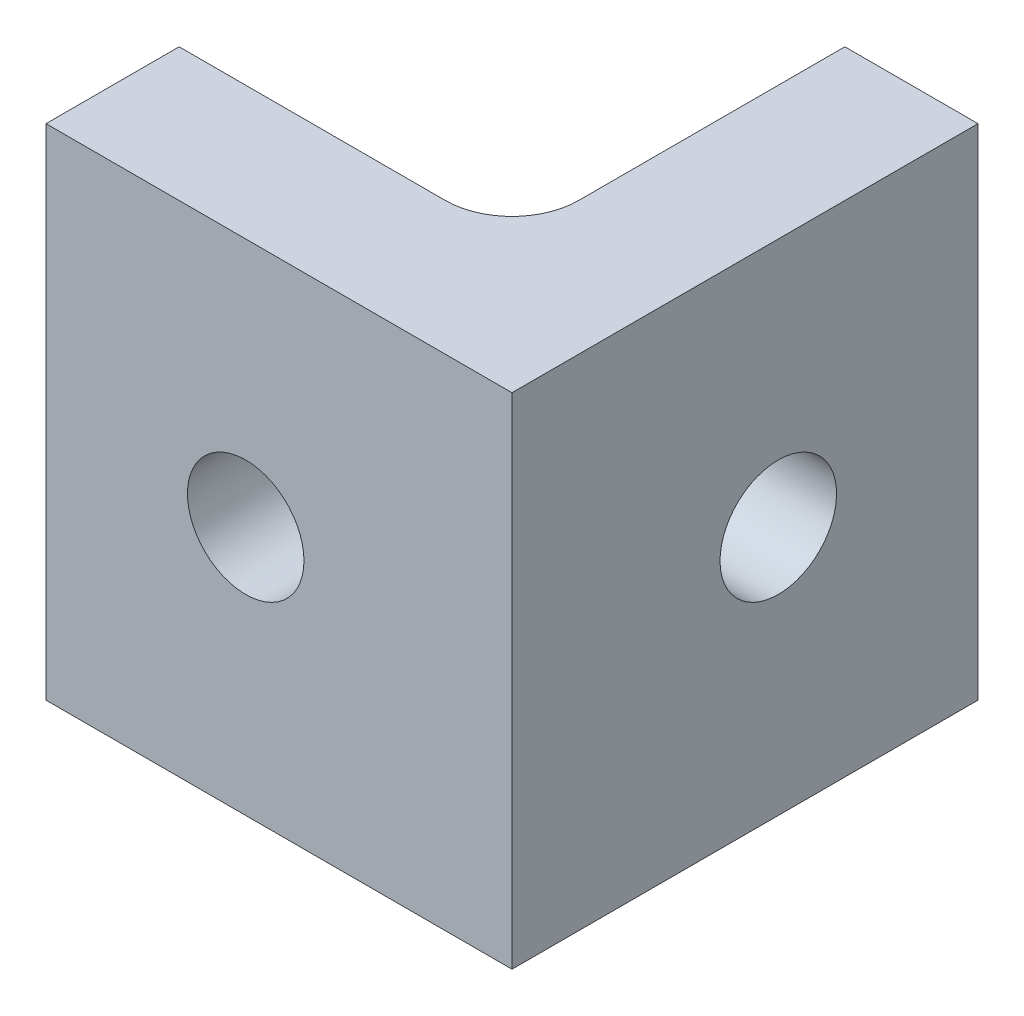
ISO-10303-21;
HEADER;
FILE_DESCRIPTION(('STEP AP214'),'2;1');
FILE_NAME('part.step','',(''),(''),'','','');
FILE_SCHEMA(('AUTOMOTIVE_DESIGN { 1 0 10303 214 1 1 1 1 }'));
ENDSEC;
DATA;
#1=APPLICATION_CONTEXT('core data for automotive mechanical design processes');
#2=APPLICATION_PROTOCOL_DEFINITION('international standard','automotive_design',2000,#1);
#3=PRODUCT_CONTEXT('',#1,'mechanical');
#4=PRODUCT('Part','Part','',(#3));
#5=PRODUCT_RELATED_PRODUCT_CATEGORY('part','',(#4));
#6=PRODUCT_DEFINITION_FORMATION('','',#4);
#7=PRODUCT_DEFINITION_CONTEXT('part definition',#1,'design');
#8=PRODUCT_DEFINITION('design','',#6,#7);
#9=PRODUCT_DEFINITION_SHAPE('','',#8);
#10=(LENGTH_UNIT() NAMED_UNIT(*) SI_UNIT(.MILLI.,.METRE.));
#11=(NAMED_UNIT(*) PLANE_ANGLE_UNIT() SI_UNIT($,.RADIAN.));
#12=(NAMED_UNIT(*) SI_UNIT($,.STERADIAN.) SOLID_ANGLE_UNIT());
#13=UNCERTAINTY_MEASURE_WITH_UNIT(LENGTH_MEASURE(1.E-05),#10,'distance_accuracy_value','');
#14=(GEOMETRIC_REPRESENTATION_CONTEXT(3) GLOBAL_UNCERTAINTY_ASSIGNED_CONTEXT((#13)) GLOBAL_UNIT_ASSIGNED_CONTEXT((#10,
#11,#12)) REPRESENTATION_CONTEXT('',''));
#15=CARTESIAN_POINT('',(0.,0.,0.));
#16=DIRECTION('',(0.,0.,1.));
#17=DIRECTION('',(1.,0.,0.));
#18=AXIS2_PLACEMENT_3D('',#15,#16,#17);
#19=CARTESIAN_POINT('',(0.,0.,4.));
#20=DIRECTION('',(0.,0.,1.));
#21=DIRECTION('',(1.,0.,0.));
#22=AXIS2_PLACEMENT_3D('',#19,#20,#21);
#23=PLANE('',#22);
#24=DIRECTION('',(0.,-1.,0.));
#25=VECTOR('',#24,1.);
#26=CARTESIAN_POINT('',(-4.,7.5,4.));
#27=LINE('',#26,#25);
#28=CARTESIAN_POINT('',(-4.,7.5,4.));
#29=VERTEX_POINT('',#28);
#30=CARTESIAN_POINT('',(-4.,-7.5,4.));
#31=VERTEX_POINT('',#30);
#32=EDGE_CURVE('E50',#29,#31,#27,.T.);
#33=ORIENTED_EDGE('',*,*,#32,.T.);
#34=DIRECTION('',(1.,0.,0.));
#35=VECTOR('',#34,1.);
#36=CARTESIAN_POINT('',(6.,-7.5,4.));
#37=LINE('',#36,#35);
#38=CARTESIAN_POINT('',(10.,-7.5,4.));
#39=VERTEX_POINT('',#38);
#40=EDGE_CURVE('E105',#31,#39,#37,.T.);
#41=ORIENTED_EDGE('',*,*,#40,.T.);
#42=DIRECTION('',(0.,-1.,0.));
#43=VECTOR('',#42,1.);
#44=CARTESIAN_POINT('',(10.,7.5,4.));
#45=LINE('',#44,#43);
#46=CARTESIAN_POINT('',(10.,7.5,4.));
#47=VERTEX_POINT('',#46);
#48=EDGE_CURVE('E153',#47,#39,#45,.T.);
#49=ORIENTED_EDGE('',*,*,#48,.F.);
#50=DIRECTION('',(-1.,0.,0.));
#51=VECTOR('',#50,1.);
#52=CARTESIAN_POINT('',(6.,7.5,4.));
#53=LINE('',#52,#51);
#54=EDGE_CURVE('E108',#47,#29,#53,.T.);
#55=ORIENTED_EDGE('',*,*,#54,.T.);
#56=EDGE_LOOP('',(#33,#41,#49,#55));
#57=FACE_BOUND('',#56,.T.);
#58=CARTESIAN_POINT('',(2.,0.,4.));
#59=DIRECTION('',(0.,0.,1.));
#60=DIRECTION('',(1.,0.,0.));
#61=AXIS2_PLACEMENT_3D('',#58,#59,#60);
#62=CIRCLE('',#61,1.75);
#63=CARTESIAN_POINT('',(3.75,0.,4.));
#64=VERTEX_POINT('',#63);
#65=EDGE_CURVE('E126',#64,#64,#62,.T.);
#66=ORIENTED_EDGE('',*,*,#65,.F.);
#67=EDGE_LOOP('',(#66));
#68=FACE_BOUND('',#67,.T.);
#69=ADVANCED_FACE('F35',(#57,#68),#23,.T.);
#70=CARTESIAN_POINT('',(0.,0.,0.));
#71=DIRECTION('',(0.,0.,1.));
#72=DIRECTION('',(1.,0.,0.));
#73=AXIS2_PLACEMENT_3D('',#70,#71,#72);
#74=PLANE('',#73);
#75=DIRECTION('',(1.,0.,0.));
#76=VECTOR('',#75,1.);
#77=CARTESIAN_POINT('',(6.,-7.5,0.));
#78=LINE('',#77,#76);
#79=CARTESIAN_POINT('',(-4.,-7.5,0.));
#80=VERTEX_POINT('',#79);
#81=CARTESIAN_POINT('',(4.,-7.5,0.));
#82=VERTEX_POINT('',#81);
#83=EDGE_CURVE('E120',#80,#82,#78,.T.);
#84=ORIENTED_EDGE('',*,*,#83,.F.);
#85=DIRECTION('',(0.,-1.,0.));
#86=VECTOR('',#85,1.);
#87=CARTESIAN_POINT('',(-4.,7.5,0.));
#88=LINE('',#87,#86);
#89=CARTESIAN_POINT('',(-4.,7.5,0.));
#90=VERTEX_POINT('',#89);
#91=EDGE_CURVE('E94',#90,#80,#88,.T.);
#92=ORIENTED_EDGE('',*,*,#91,.F.);
#93=DIRECTION('',(-1.,0.,0.));
#94=VECTOR('',#93,1.);
#95=CARTESIAN_POINT('',(6.,7.5,0.));
#96=LINE('',#95,#94);
#97=CARTESIAN_POINT('',(4.,7.5,0.));
#98=VERTEX_POINT('',#97);
#99=EDGE_CURVE('E115',#98,#90,#96,.T.);
#100=ORIENTED_EDGE('',*,*,#99,.F.);
#101=DIRECTION('',(0.,1.,0.));
#102=VECTOR('',#101,1.);
#103=CARTESIAN_POINT('',(4.,-7.5,0.));
#104=LINE('',#103,#102);
#105=EDGE_CURVE('E130',#98,#82,#104,.F.);
#106=ORIENTED_EDGE('',*,*,#105,.T.);
#107=EDGE_LOOP('',(#84,#92,#100,#106));
#108=FACE_BOUND('',#107,.T.);
#109=CARTESIAN_POINT('',(2.,0.,0.));
#110=DIRECTION('',(0.,0.,1.));
#111=DIRECTION('',(1.,0.,0.));
#112=AXIS2_PLACEMENT_3D('',#109,#110,#111);
#113=CIRCLE('',#112,1.75);
#114=CARTESIAN_POINT('',(3.75,0.,0.));
#115=VERTEX_POINT('',#114);
#116=EDGE_CURVE('E123',#115,#115,#113,.T.);
#117=ORIENTED_EDGE('',*,*,#116,.T.);
#118=EDGE_LOOP('',(#117));
#119=FACE_BOUND('',#118,.T.);
#120=ADVANCED_FACE('F142',(#108,#119),#74,.F.);
#121=CARTESIAN_POINT('',(6.,-7.5,4.));
#122=DIRECTION('',(0.,1.,0.));
#123=DIRECTION('',(-1.,0.,0.));
#124=AXIS2_PLACEMENT_3D('',#121,#122,#123);
#125=PLANE('',#124);
#126=ORIENTED_EDGE('',*,*,#40,.F.);
#127=DIRECTION('',(0.,0.,-1.));
#128=VECTOR('',#127,1.);
#129=CARTESIAN_POINT('',(-4.,-7.5,4.));
#130=LINE('',#129,#128);
#131=EDGE_CURVE('E91',#31,#80,#130,.T.);
#132=ORIENTED_EDGE('',*,*,#131,.T.);
#133=ORIENTED_EDGE('',*,*,#83,.T.);
#134=CARTESIAN_POINT('',(4.,-7.5,-2.));
#135=DIRECTION('',(0.,1.,0.));
#136=DIRECTION('',(-1.,0.,0.));
#137=AXIS2_PLACEMENT_3D('',#134,#135,#136);
#138=CIRCLE('',#137,2.);
#139=CARTESIAN_POINT('',(6.,-7.5,-2.));
#140=VERTEX_POINT('',#139);
#141=EDGE_CURVE('E11',#82,#140,#138,.T.);
#142=ORIENTED_EDGE('',*,*,#141,.T.);
#143=DIRECTION('',(0.,0.,-1.));
#144=VECTOR('',#143,1.);
#145=CARTESIAN_POINT('',(6.,-7.5,4.));
#146=LINE('',#145,#144);
#147=CARTESIAN_POINT('',(6.,-7.5,-10.));
#148=VERTEX_POINT('',#147);
#149=EDGE_CURVE('E147',#140,#148,#146,.T.);
#150=ORIENTED_EDGE('',*,*,#149,.T.);
#151=DIRECTION('',(-1.,0.,0.));
#152=VECTOR('',#151,1.);
#153=CARTESIAN_POINT('',(10.,-7.5,-10.));
#154=LINE('',#153,#152);
#155=CARTESIAN_POINT('',(10.,-7.5,-10.));
#156=VERTEX_POINT('',#155);
#157=EDGE_CURVE('E171',#156,#148,#154,.T.);
#158=ORIENTED_EDGE('',*,*,#157,.F.);
#159=DIRECTION('',(0.,0.,-1.));
#160=VECTOR('',#159,1.);
#161=CARTESIAN_POINT('',(10.,-7.5,4.));
#162=LINE('',#161,#160);
#163=EDGE_CURVE('E114',#39,#156,#162,.T.);
#164=ORIENTED_EDGE('',*,*,#163,.F.);
#165=EDGE_LOOP('',(#126,#132,#133,#142,#150,#158,#164));
#166=FACE_BOUND('',#165,.T.);
#167=ADVANCED_FACE('F111',(#166),#125,.F.);
#168=CARTESIAN_POINT('',(6.,7.5,4.));
#169=DIRECTION('',(0.,-1.,0.));
#170=DIRECTION('',(1.,0.,0.));
#171=AXIS2_PLACEMENT_3D('',#168,#169,#170);
#172=PLANE('',#171);
#173=ORIENTED_EDGE('',*,*,#99,.T.);
#174=DIRECTION('',(0.,0.,-1.));
#175=VECTOR('',#174,1.);
#176=CARTESIAN_POINT('',(-4.,7.5,4.));
#177=LINE('',#176,#175);
#178=EDGE_CURVE('E99',#29,#90,#177,.T.);
#179=ORIENTED_EDGE('',*,*,#178,.F.);
#180=ORIENTED_EDGE('',*,*,#54,.F.);
#181=DIRECTION('',(0.,0.,1.));
#182=VECTOR('',#181,1.);
#183=CARTESIAN_POINT('',(10.,7.5,-12.));
#184=LINE('',#183,#182);
#185=CARTESIAN_POINT('',(10.,7.5,-10.));
#186=VERTEX_POINT('',#185);
#187=EDGE_CURVE('E151',#186,#47,#184,.T.);
#188=ORIENTED_EDGE('',*,*,#187,.F.);
#189=DIRECTION('',(-1.,0.,0.));
#190=VECTOR('',#189,1.);
#191=CARTESIAN_POINT('',(10.,7.5,-10.));
#192=LINE('',#191,#190);
#193=CARTESIAN_POINT('',(6.,7.5,-10.));
#194=VERTEX_POINT('',#193);
#195=EDGE_CURVE('E58',#186,#194,#192,.T.);
#196=ORIENTED_EDGE('',*,*,#195,.T.);
#197=DIRECTION('',(0.,0.,1.));
#198=VECTOR('',#197,1.);
#199=CARTESIAN_POINT('',(6.,7.5,-12.));
#200=LINE('',#199,#198);
#201=CARTESIAN_POINT('',(6.,7.5,-2.));
#202=VERTEX_POINT('',#201);
#203=EDGE_CURVE('E137',#194,#202,#200,.T.);
#204=ORIENTED_EDGE('',*,*,#203,.T.);
#205=CARTESIAN_POINT('',(4.,7.5,-2.));
#206=DIRECTION('',(0.,-1.,0.));
#207=DIRECTION('',(1.,0.,0.));
#208=AXIS2_PLACEMENT_3D('',#205,#206,#207);
#209=CIRCLE('',#208,2.);
#210=EDGE_CURVE('E43',#202,#98,#209,.T.);
#211=ORIENTED_EDGE('',*,*,#210,.T.);
#212=EDGE_LOOP('',(#173,#179,#180,#188,#196,#204,#211));
#213=FACE_BOUND('',#212,.T.);
#214=ADVANCED_FACE('F135',(#213),#172,.F.);
#215=CARTESIAN_POINT('',(2.,0.,4.));
#216=DIRECTION('',(0.,0.,-1.));
#217=DIRECTION('',(-1.,0.,0.));
#218=AXIS2_PLACEMENT_3D('',#215,#216,#217);
#219=CYLINDRICAL_SURFACE('',#218,1.75);
#220=ORIENTED_EDGE('',*,*,#65,.T.);
#221=EDGE_LOOP('',(#220));
#222=FACE_BOUND('',#221,.T.);
#223=ORIENTED_EDGE('',*,*,#116,.F.);
#224=EDGE_LOOP('',(#223));
#225=FACE_BOUND('',#224,.T.);
#226=ADVANCED_FACE('F198',(#222,#225),#219,.F.);
#227=CARTESIAN_POINT('',(6.,0.,0.));
#228=DIRECTION('',(1.,0.,0.));
#229=DIRECTION('',(0.,1.,0.));
#230=AXIS2_PLACEMENT_3D('',#227,#228,#229);
#231=PLANE('',#230);
#232=CARTESIAN_POINT('',(6.,0.,-4.));
#233=DIRECTION('',(1.,0.,0.));
#234=DIRECTION('',(0.,1.,0.));
#235=AXIS2_PLACEMENT_3D('',#232,#233,#234);
#236=CIRCLE('',#235,1.75);
#237=CARTESIAN_POINT('',(6.,1.75,-4.));
#238=VERTEX_POINT('',#237);
#239=EDGE_CURVE('E166',#238,#238,#236,.T.);
#240=ORIENTED_EDGE('',*,*,#239,.T.);
#241=EDGE_LOOP('',(#240));
#242=FACE_BOUND('',#241,.T.);
#243=ORIENTED_EDGE('',*,*,#203,.F.);
#244=DIRECTION('',(0.,1.,0.));
#245=VECTOR('',#244,1.);
#246=CARTESIAN_POINT('',(6.,-7.5,-10.));
#247=LINE('',#246,#245);
#248=EDGE_CURVE('E98',#148,#194,#247,.T.);
#249=ORIENTED_EDGE('',*,*,#248,.F.);
#250=ORIENTED_EDGE('',*,*,#149,.F.);
#251=DIRECTION('',(0.,1.,0.));
#252=VECTOR('',#251,1.);
#253=CARTESIAN_POINT('',(6.,7.5,-2.));
#254=LINE('',#253,#252);
#255=EDGE_CURVE('E117',#140,#202,#254,.T.);
#256=ORIENTED_EDGE('',*,*,#255,.T.);
#257=EDGE_LOOP('',(#243,#249,#250,#256));
#258=FACE_BOUND('',#257,.T.);
#259=ADVANCED_FACE('F150',(#242,#258),#231,.F.);
#260=CARTESIAN_POINT('',(10.,0.,0.));
#261=DIRECTION('',(1.,0.,0.));
#262=DIRECTION('',(0.,1.,0.));
#263=AXIS2_PLACEMENT_3D('',#260,#261,#262);
#264=PLANE('',#263);
#265=DIRECTION('',(0.,1.,0.));
#266=VECTOR('',#265,1.);
#267=CARTESIAN_POINT('',(10.,-7.5,-10.));
#268=LINE('',#267,#266);
#269=EDGE_CURVE('E173',#156,#186,#268,.T.);
#270=ORIENTED_EDGE('',*,*,#269,.T.);
#271=ORIENTED_EDGE('',*,*,#187,.T.);
#272=ORIENTED_EDGE('',*,*,#48,.T.);
#273=ORIENTED_EDGE('',*,*,#163,.T.);
#274=EDGE_LOOP('',(#270,#271,#272,#273));
#275=FACE_BOUND('',#274,.T.);
#276=CARTESIAN_POINT('',(10.,0.,-4.));
#277=DIRECTION('',(1.,0.,0.));
#278=DIRECTION('',(0.,1.,0.));
#279=AXIS2_PLACEMENT_3D('',#276,#277,#278);
#280=CIRCLE('',#279,1.75);
#281=CARTESIAN_POINT('',(10.,1.75,-4.));
#282=VERTEX_POINT('',#281);
#283=EDGE_CURVE('E155',#282,#282,#280,.T.);
#284=ORIENTED_EDGE('',*,*,#283,.F.);
#285=EDGE_LOOP('',(#284));
#286=FACE_BOUND('',#285,.T.);
#287=ADVANCED_FACE('F179',(#275,#286),#264,.T.);
#288=CARTESIAN_POINT('',(10.,0.,-4.));
#289=DIRECTION('',(-1.,0.,0.));
#290=DIRECTION('',(0.,-1.,0.));
#291=AXIS2_PLACEMENT_3D('',#288,#289,#290);
#292=CYLINDRICAL_SURFACE('',#291,1.75);
#293=ORIENTED_EDGE('',*,*,#283,.T.);
#294=EDGE_LOOP('',(#293));
#295=FACE_BOUND('',#294,.T.);
#296=ORIENTED_EDGE('',*,*,#239,.F.);
#297=EDGE_LOOP('',(#296));
#298=FACE_BOUND('',#297,.T.);
#299=ADVANCED_FACE('F189',(#295,#298),#292,.F.);
#300=CARTESIAN_POINT('',(4.,0.,-2.));
#301=DIRECTION('',(0.,-1.,0.));
#302=DIRECTION('',(1.,0.,0.));
#303=AXIS2_PLACEMENT_3D('',#300,#301,#302);
#304=CYLINDRICAL_SURFACE('',#303,2.);
#305=ORIENTED_EDGE('',*,*,#141,.F.);
#306=ORIENTED_EDGE('',*,*,#105,.F.);
#307=ORIENTED_EDGE('',*,*,#210,.F.);
#308=ORIENTED_EDGE('',*,*,#255,.F.);
#309=EDGE_LOOP('',(#305,#306,#307,#308));
#310=FACE_BOUND('',#309,.T.);
#311=ADVANCED_FACE('F37',(#310),#304,.F.);
#312=CARTESIAN_POINT('',(10.,-7.5,-10.));
#313=DIRECTION('',(0.,0.,1.));
#314=DIRECTION('',(1.,0.,0.));
#315=AXIS2_PLACEMENT_3D('',#312,#313,#314);
#316=PLANE('',#315);
#317=ORIENTED_EDGE('',*,*,#248,.T.);
#318=ORIENTED_EDGE('',*,*,#195,.F.);
#319=ORIENTED_EDGE('',*,*,#269,.F.);
#320=ORIENTED_EDGE('',*,*,#157,.T.);
#321=EDGE_LOOP('',(#317,#318,#319,#320));
#322=FACE_BOUND('',#321,.T.);
#323=ADVANCED_FACE('F181',(#322),#316,.F.);
#324=CARTESIAN_POINT('',(-4.,7.5,4.));
#325=DIRECTION('',(1.,0.,0.));
#326=DIRECTION('',(0.,1.,0.));
#327=AXIS2_PLACEMENT_3D('',#324,#325,#326);
#328=PLANE('',#327);
#329=ORIENTED_EDGE('',*,*,#91,.T.);
#330=ORIENTED_EDGE('',*,*,#131,.F.);
#331=ORIENTED_EDGE('',*,*,#32,.F.);
#332=ORIENTED_EDGE('',*,*,#178,.T.);
#333=EDGE_LOOP('',(#329,#330,#331,#332));
#334=FACE_BOUND('',#333,.T.);
#335=ADVANCED_FACE('F92',(#334),#328,.F.);
#336=CLOSED_SHELL('',(#69,#120,#167,#214,#226,#259,#287,#299,#311,#323,#335));
#337=MANIFOLD_SOLID_BREP('B2',#336);
#338=ADVANCED_BREP_SHAPE_REPRESENTATION('',(#18,#337),#14);
#339=SHAPE_DEFINITION_REPRESENTATION(#9,#338);
ENDSEC;
END-ISO-10303-21;
